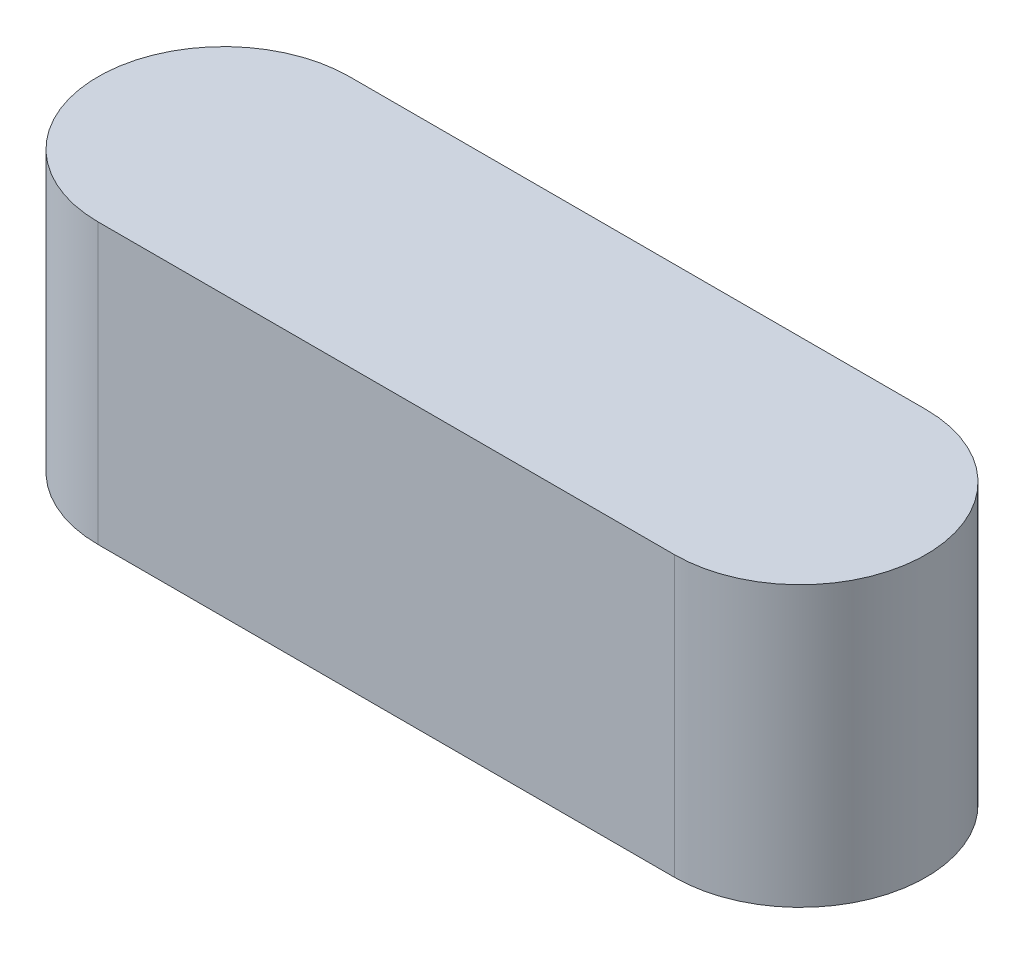
ISO-10303-21;
HEADER;
FILE_DESCRIPTION(('STEP AP214'),'2;1');
FILE_NAME('part.step','',(''),(''),'','','');
FILE_SCHEMA(('AUTOMOTIVE_DESIGN { 1 0 10303 214 1 1 1 1 }'));
ENDSEC;
DATA;
#1=APPLICATION_CONTEXT('core data for automotive mechanical design processes');
#2=APPLICATION_PROTOCOL_DEFINITION('international standard','automotive_design',2000,#1);
#3=PRODUCT_CONTEXT('',#1,'mechanical');
#4=PRODUCT('Part','Part','',(#3));
#5=PRODUCT_RELATED_PRODUCT_CATEGORY('part','',(#4));
#6=PRODUCT_DEFINITION_FORMATION('','',#4);
#7=PRODUCT_DEFINITION_CONTEXT('part definition',#1,'design');
#8=PRODUCT_DEFINITION('design','',#6,#7);
#9=PRODUCT_DEFINITION_SHAPE('','',#8);
#10=(LENGTH_UNIT() NAMED_UNIT(*) SI_UNIT(.MILLI.,.METRE.));
#11=(NAMED_UNIT(*) PLANE_ANGLE_UNIT() SI_UNIT($,.RADIAN.));
#12=(NAMED_UNIT(*) SI_UNIT($,.STERADIAN.) SOLID_ANGLE_UNIT());
#13=UNCERTAINTY_MEASURE_WITH_UNIT(LENGTH_MEASURE(1.E-05),#10,'distance_accuracy_value','');
#14=(GEOMETRIC_REPRESENTATION_CONTEXT(3) GLOBAL_UNCERTAINTY_ASSIGNED_CONTEXT((#13)) GLOBAL_UNIT_ASSIGNED_CONTEXT((#10,
#11,#12)) REPRESENTATION_CONTEXT('',''));
#15=CARTESIAN_POINT('',(0.,0.,0.));
#16=DIRECTION('',(0.,0.,1.));
#17=DIRECTION('',(1.,0.,0.));
#18=AXIS2_PLACEMENT_3D('',#15,#16,#17);
#19=CARTESIAN_POINT('',(0.,0.,0.));
#20=DIRECTION('',(0.,1.,0.));
#21=DIRECTION('',(0.,0.,1.));
#22=AXIS2_PLACEMENT_3D('',#19,#20,#21);
#23=PLANE('',#22);
#24=CARTESIAN_POINT('',(0.,0.,0.));
#25=DIRECTION('',(0.,1.,0.));
#26=DIRECTION('',(0.,0.,1.));
#27=AXIS2_PLACEMENT_3D('',#24,#25,#26);
#28=CIRCLE('',#27,12.15);
#29=CARTESIAN_POINT('',(0.,0.,-12.15));
#30=VERTEX_POINT('',#29);
#31=CARTESIAN_POINT('',(0.,0.,12.15));
#32=VERTEX_POINT('',#31);
#33=EDGE_CURVE('E129',#30,#32,#28,.T.);
#34=ORIENTED_EDGE('',*,*,#33,.F.);
#35=DIRECTION('',(-1.,0.,0.));
#36=VECTOR('',#35,1.);
#37=CARTESIAN_POINT('',(0.,0.,-12.15));
#38=LINE('',#37,#36);
#39=CARTESIAN_POINT('',(55.7,0.,-12.15));
#40=VERTEX_POINT('',#39);
#41=EDGE_CURVE('E145',#40,#30,#38,.T.);
#42=ORIENTED_EDGE('',*,*,#41,.F.);
#43=CARTESIAN_POINT('',(55.7,0.,0.));
#44=DIRECTION('',(0.,1.,0.));
#45=DIRECTION('',(0.,0.,1.));
#46=AXIS2_PLACEMENT_3D('',#43,#44,#45);
#47=CIRCLE('',#46,12.15);
#48=CARTESIAN_POINT('',(55.7,0.,12.15));
#49=VERTEX_POINT('',#48);
#50=EDGE_CURVE('E157',#49,#40,#47,.T.);
#51=ORIENTED_EDGE('',*,*,#50,.F.);
#52=DIRECTION('',(1.,0.,0.));
#53=VECTOR('',#52,1.);
#54=CARTESIAN_POINT('',(0.,0.,12.15));
#55=LINE('',#54,#53);
#56=EDGE_CURVE('E134',#32,#49,#55,.T.);
#57=ORIENTED_EDGE('',*,*,#56,.F.);
#58=EDGE_LOOP('',(#34,#42,#51,#57));
#59=FACE_BOUND('',#58,.T.);
#60=DIRECTION('',(0.,0.,-1.));
#61=VECTOR('',#60,1.);
#62=CARTESIAN_POINT('',(20.35,0.,-8.85));
#63=LINE('',#62,#61);
#64=CARTESIAN_POINT('',(20.35,0.,-0.849999999999997));
#65=VERTEX_POINT('',#64);
#66=CARTESIAN_POINT('',(20.35,0.,-8.85));
#67=VERTEX_POINT('',#66);
#68=EDGE_CURVE('E127',#65,#67,#63,.T.);
#69=ORIENTED_EDGE('',*,*,#68,.F.);
#70=DIRECTION('',(-1.,0.,0.));
#71=VECTOR('',#70,1.);
#72=CARTESIAN_POINT('',(20.35,0.,-0.849999999999997));
#73=LINE('',#72,#71);
#74=CARTESIAN_POINT('',(35.35,0.,-0.849999999999997));
#75=VERTEX_POINT('',#74);
#76=EDGE_CURVE('E124',#75,#65,#73,.T.);
#77=ORIENTED_EDGE('',*,*,#76,.F.);
#78=DIRECTION('',(0.,0.,1.));
#79=VECTOR('',#78,1.);
#80=CARTESIAN_POINT('',(35.35,0.,-8.85));
#81=LINE('',#80,#79);
#82=CARTESIAN_POINT('',(35.35,0.,-8.85));
#83=VERTEX_POINT('',#82);
#84=EDGE_CURVE('E60',#83,#75,#81,.T.);
#85=ORIENTED_EDGE('',*,*,#84,.F.);
#86=DIRECTION('',(1.,0.,0.));
#87=VECTOR('',#86,1.);
#88=CARTESIAN_POINT('',(20.35,0.,-8.85));
#89=LINE('',#88,#87);
#90=EDGE_CURVE('E55',#67,#83,#89,.T.);
#91=ORIENTED_EDGE('',*,*,#90,.F.);
#92=EDGE_LOOP('',(#69,#77,#85,#91));
#93=FACE_BOUND('',#92,.T.);
#94=ADVANCED_FACE('F39',(#59,#93),#23,.F.);
#95=CARTESIAN_POINT('',(0.,27.,0.));
#96=DIRECTION('',(0.,-1.,0.));
#97=DIRECTION('',(0.,0.,-1.));
#98=AXIS2_PLACEMENT_3D('',#95,#96,#97);
#99=CYLINDRICAL_SURFACE('',#98,12.15);
#100=ORIENTED_EDGE('',*,*,#33,.T.);
#101=DIRECTION('',(0.,-1.,0.));
#102=VECTOR('',#101,1.);
#103=CARTESIAN_POINT('',(0.,27.,12.15));
#104=LINE('',#103,#102);
#105=CARTESIAN_POINT('',(0.,27.,12.15));
#106=VERTEX_POINT('',#105);
#107=EDGE_CURVE('E11',#106,#32,#104,.T.);
#108=ORIENTED_EDGE('',*,*,#107,.F.);
#109=CARTESIAN_POINT('',(0.,27.,0.));
#110=DIRECTION('',(0.,1.,0.));
#111=DIRECTION('',(0.,0.,1.));
#112=AXIS2_PLACEMENT_3D('',#109,#110,#111);
#113=CIRCLE('',#112,12.15);
#114=CARTESIAN_POINT('',(0.,27.,-12.15));
#115=VERTEX_POINT('',#114);
#116=EDGE_CURVE('E140',#115,#106,#113,.T.);
#117=ORIENTED_EDGE('',*,*,#116,.F.);
#118=DIRECTION('',(0.,-1.,0.));
#119=VECTOR('',#118,1.);
#120=CARTESIAN_POINT('',(0.,27.,-12.15));
#121=LINE('',#120,#119);
#122=EDGE_CURVE('E153',#115,#30,#121,.T.);
#123=ORIENTED_EDGE('',*,*,#122,.T.);
#124=EDGE_LOOP('',(#100,#108,#117,#123));
#125=FACE_BOUND('',#124,.T.);
#126=ADVANCED_FACE('F41',(#125),#99,.T.);
#127=CARTESIAN_POINT('',(0.,27.,12.15));
#128=DIRECTION('',(0.,0.,-1.));
#129=DIRECTION('',(-1.,0.,0.));
#130=AXIS2_PLACEMENT_3D('',#127,#128,#129);
#131=PLANE('',#130);
#132=ORIENTED_EDGE('',*,*,#56,.T.);
#133=DIRECTION('',(0.,-1.,0.));
#134=VECTOR('',#133,1.);
#135=CARTESIAN_POINT('',(55.7,27.,12.15));
#136=LINE('',#135,#134);
#137=CARTESIAN_POINT('',(55.7,27.,12.15));
#138=VERTEX_POINT('',#137);
#139=EDGE_CURVE('E48',#138,#49,#136,.T.);
#140=ORIENTED_EDGE('',*,*,#139,.F.);
#141=DIRECTION('',(1.,0.,0.));
#142=VECTOR('',#141,1.);
#143=CARTESIAN_POINT('',(0.,27.,12.15));
#144=LINE('',#143,#142);
#145=EDGE_CURVE('E144',#106,#138,#144,.T.);
#146=ORIENTED_EDGE('',*,*,#145,.F.);
#147=ORIENTED_EDGE('',*,*,#107,.T.);
#148=EDGE_LOOP('',(#132,#140,#146,#147));
#149=FACE_BOUND('',#148,.T.);
#150=ADVANCED_FACE('F189',(#149),#131,.F.);
#151=CARTESIAN_POINT('',(55.7,27.,0.));
#152=DIRECTION('',(0.,-1.,0.));
#153=DIRECTION('',(0.,0.,-1.));
#154=AXIS2_PLACEMENT_3D('',#151,#152,#153);
#155=CYLINDRICAL_SURFACE('',#154,12.15);
#156=ORIENTED_EDGE('',*,*,#50,.T.);
#157=DIRECTION('',(0.,-1.,0.));
#158=VECTOR('',#157,1.);
#159=CARTESIAN_POINT('',(55.7,27.,-12.15));
#160=LINE('',#159,#158);
#161=CARTESIAN_POINT('',(55.7,27.,-12.15));
#162=VERTEX_POINT('',#161);
#163=EDGE_CURVE('E165',#162,#40,#160,.T.);
#164=ORIENTED_EDGE('',*,*,#163,.F.);
#165=CARTESIAN_POINT('',(55.7,27.,0.));
#166=DIRECTION('',(0.,1.,0.));
#167=DIRECTION('',(0.,0.,1.));
#168=AXIS2_PLACEMENT_3D('',#165,#166,#167);
#169=CIRCLE('',#168,12.15);
#170=EDGE_CURVE('E148',#138,#162,#169,.T.);
#171=ORIENTED_EDGE('',*,*,#170,.F.);
#172=ORIENTED_EDGE('',*,*,#139,.T.);
#173=EDGE_LOOP('',(#156,#164,#171,#172));
#174=FACE_BOUND('',#173,.T.);
#175=ADVANCED_FACE('F174',(#174),#155,.T.);
#176=CARTESIAN_POINT('',(0.,27.,-12.15));
#177=DIRECTION('',(0.,0.,1.));
#178=DIRECTION('',(1.,0.,0.));
#179=AXIS2_PLACEMENT_3D('',#176,#177,#178);
#180=PLANE('',#179);
#181=ORIENTED_EDGE('',*,*,#41,.T.);
#182=ORIENTED_EDGE('',*,*,#122,.F.);
#183=DIRECTION('',(-1.,0.,0.));
#184=VECTOR('',#183,1.);
#185=CARTESIAN_POINT('',(0.,27.,-12.15));
#186=LINE('',#185,#184);
#187=EDGE_CURVE('E151',#162,#115,#186,.T.);
#188=ORIENTED_EDGE('',*,*,#187,.F.);
#189=ORIENTED_EDGE('',*,*,#163,.T.);
#190=EDGE_LOOP('',(#181,#182,#188,#189));
#191=FACE_BOUND('',#190,.T.);
#192=ADVANCED_FACE('F182',(#191),#180,.F.);
#193=CARTESIAN_POINT('',(0.,27.,0.));
#194=DIRECTION('',(0.,1.,0.));
#195=DIRECTION('',(0.,0.,1.));
#196=AXIS2_PLACEMENT_3D('',#193,#194,#195);
#197=PLANE('',#196);
#198=ORIENTED_EDGE('',*,*,#116,.T.);
#199=ORIENTED_EDGE('',*,*,#145,.T.);
#200=ORIENTED_EDGE('',*,*,#170,.T.);
#201=ORIENTED_EDGE('',*,*,#187,.T.);
#202=EDGE_LOOP('',(#198,#199,#200,#201));
#203=FACE_BOUND('',#202,.T.);
#204=ADVANCED_FACE('F188',(#203),#197,.T.);
#205=CARTESIAN_POINT('',(20.35,-5.,-8.85));
#206=DIRECTION('',(1.,0.,0.));
#207=DIRECTION('',(0.,0.,-1.));
#208=AXIS2_PLACEMENT_3D('',#205,#206,#207);
#209=PLANE('',#208);
#210=ORIENTED_EDGE('',*,*,#68,.T.);
#211=DIRECTION('',(0.,1.,0.));
#212=VECTOR('',#211,1.);
#213=CARTESIAN_POINT('',(20.35,-5.,-8.85));
#214=LINE('',#213,#212);
#215=CARTESIAN_POINT('',(20.35,-5.,-8.85));
#216=VERTEX_POINT('',#215);
#217=EDGE_CURVE('E106',#216,#67,#214,.T.);
#218=ORIENTED_EDGE('',*,*,#217,.F.);
#219=DIRECTION('',(0.,0.,-1.));
#220=VECTOR('',#219,1.);
#221=CARTESIAN_POINT('',(20.35,-5.,-8.85));
#222=LINE('',#221,#220);
#223=CARTESIAN_POINT('',(20.35,-5.,-0.849999999999997));
#224=VERTEX_POINT('',#223);
#225=EDGE_CURVE('E114',#224,#216,#222,.T.);
#226=ORIENTED_EDGE('',*,*,#225,.F.);
#227=DIRECTION('',(0.,1.,0.));
#228=VECTOR('',#227,1.);
#229=CARTESIAN_POINT('',(20.35,-5.,-0.849999999999997));
#230=LINE('',#229,#228);
#231=EDGE_CURVE('E282',#224,#65,#230,.T.);
#232=ORIENTED_EDGE('',*,*,#231,.T.);
#233=EDGE_LOOP('',(#210,#218,#226,#232));
#234=FACE_BOUND('',#233,.T.);
#235=ADVANCED_FACE('F126',(#234),#209,.F.);
#236=CARTESIAN_POINT('',(20.35,-5.,-8.85));
#237=DIRECTION('',(0.,0.,1.));
#238=DIRECTION('',(1.,0.,0.));
#239=AXIS2_PLACEMENT_3D('',#236,#237,#238);
#240=PLANE('',#239);
#241=ORIENTED_EDGE('',*,*,#90,.T.);
#242=DIRECTION('',(0.,1.,0.));
#243=VECTOR('',#242,1.);
#244=CARTESIAN_POINT('',(35.35,-5.,-8.85));
#245=LINE('',#244,#243);
#246=CARTESIAN_POINT('',(35.35,-5.,-8.85));
#247=VERTEX_POINT('',#246);
#248=EDGE_CURVE('E109',#247,#83,#245,.T.);
#249=ORIENTED_EDGE('',*,*,#248,.F.);
#250=DIRECTION('',(1.,0.,0.));
#251=VECTOR('',#250,1.);
#252=CARTESIAN_POINT('',(20.35,-5.,-8.85));
#253=LINE('',#252,#251);
#254=EDGE_CURVE('E102',#216,#247,#253,.T.);
#255=ORIENTED_EDGE('',*,*,#254,.F.);
#256=ORIENTED_EDGE('',*,*,#217,.T.);
#257=EDGE_LOOP('',(#241,#249,#255,#256));
#258=FACE_BOUND('',#257,.T.);
#259=ADVANCED_FACE('F104',(#258),#240,.F.);
#260=CARTESIAN_POINT('',(35.35,-5.,-8.85));
#261=DIRECTION('',(-1.,0.,0.));
#262=DIRECTION('',(0.,0.,1.));
#263=AXIS2_PLACEMENT_3D('',#260,#261,#262);
#264=PLANE('',#263);
#265=ORIENTED_EDGE('',*,*,#84,.T.);
#266=DIRECTION('',(0.,1.,0.));
#267=VECTOR('',#266,1.);
#268=CARTESIAN_POINT('',(35.35,-5.,-0.849999999999997));
#269=LINE('',#268,#267);
#270=CARTESIAN_POINT('',(35.35,-5.,-0.849999999999997));
#271=VERTEX_POINT('',#270);
#272=EDGE_CURVE('E136',#271,#75,#269,.T.);
#273=ORIENTED_EDGE('',*,*,#272,.F.);
#274=DIRECTION('',(0.,0.,1.));
#275=VECTOR('',#274,1.);
#276=CARTESIAN_POINT('',(35.35,-5.,-8.85));
#277=LINE('',#276,#275);
#278=EDGE_CURVE('E113',#247,#271,#277,.T.);
#279=ORIENTED_EDGE('',*,*,#278,.F.);
#280=ORIENTED_EDGE('',*,*,#248,.T.);
#281=EDGE_LOOP('',(#265,#273,#279,#280));
#282=FACE_BOUND('',#281,.T.);
#283=ADVANCED_FACE('F213',(#282),#264,.F.);
#284=CARTESIAN_POINT('',(20.35,-5.,-0.849999999999997));
#285=DIRECTION('',(0.,0.,-1.));
#286=DIRECTION('',(-1.,0.,0.));
#287=AXIS2_PLACEMENT_3D('',#284,#285,#286);
#288=PLANE('',#287);
#289=ORIENTED_EDGE('',*,*,#76,.T.);
#290=ORIENTED_EDGE('',*,*,#231,.F.);
#291=DIRECTION('',(-1.,0.,0.));
#292=VECTOR('',#291,1.);
#293=CARTESIAN_POINT('',(20.35,-5.,-0.849999999999997));
#294=LINE('',#293,#292);
#295=EDGE_CURVE('E119',#271,#224,#294,.T.);
#296=ORIENTED_EDGE('',*,*,#295,.F.);
#297=ORIENTED_EDGE('',*,*,#272,.T.);
#298=EDGE_LOOP('',(#289,#290,#296,#297));
#299=FACE_BOUND('',#298,.T.);
#300=ADVANCED_FACE('F218',(#299),#288,.F.);
#301=CARTESIAN_POINT('',(0.,-5.,0.));
#302=DIRECTION('',(0.,1.,0.));
#303=DIRECTION('',(0.,0.,1.));
#304=AXIS2_PLACEMENT_3D('',#301,#302,#303);
#305=PLANE('',#304);
#306=ORIENTED_EDGE('',*,*,#225,.T.);
#307=ORIENTED_EDGE('',*,*,#254,.T.);
#308=ORIENTED_EDGE('',*,*,#278,.T.);
#309=ORIENTED_EDGE('',*,*,#295,.T.);
#310=EDGE_LOOP('',(#306,#307,#308,#309));
#311=FACE_BOUND('',#310,.T.);
#312=ADVANCED_FACE('F117',(#311),#305,.F.);
#313=CLOSED_SHELL('',(#94,#126,#150,#175,#192,#204,#235,#259,#283,#300,#312));
#314=MANIFOLD_SOLID_BREP('B2',#313);
#315=ADVANCED_BREP_SHAPE_REPRESENTATION('',(#18,#314),#14);
#316=SHAPE_DEFINITION_REPRESENTATION(#9,#315);
ENDSEC;
END-ISO-10303-21;
